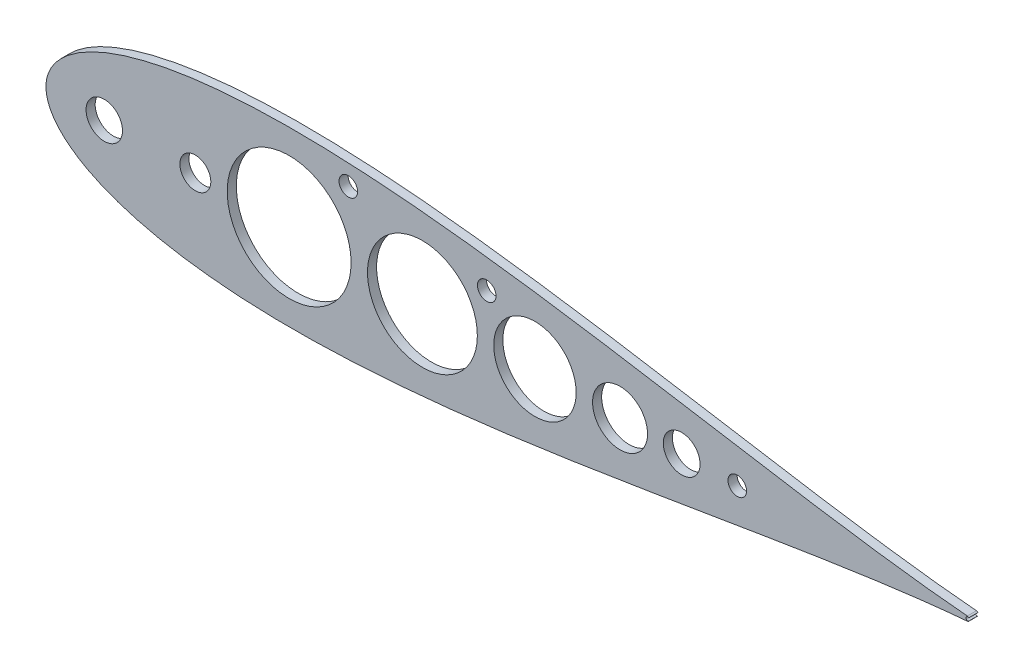
ISO-10303-21;
HEADER;
FILE_DESCRIPTION(('STEP AP214'),'2;1');
FILE_NAME('part.step','',(''),(''),'','','');
FILE_SCHEMA(('AUTOMOTIVE_DESIGN { 1 0 10303 214 1 1 1 1 }'));
ENDSEC;
DATA;
#1=APPLICATION_CONTEXT('core data for automotive mechanical design processes');
#2=APPLICATION_PROTOCOL_DEFINITION('international standard','automotive_design',2000,#1);
#3=PRODUCT_CONTEXT('',#1,'mechanical');
#4=PRODUCT('Part','Part','',(#3));
#5=PRODUCT_RELATED_PRODUCT_CATEGORY('part','',(#4));
#6=PRODUCT_DEFINITION_FORMATION('','',#4);
#7=PRODUCT_DEFINITION_CONTEXT('part definition',#1,'design');
#8=PRODUCT_DEFINITION('design','',#6,#7);
#9=PRODUCT_DEFINITION_SHAPE('','',#8);
#10=(LENGTH_UNIT() NAMED_UNIT(*) SI_UNIT(.MILLI.,.METRE.));
#11=(NAMED_UNIT(*) PLANE_ANGLE_UNIT() SI_UNIT($,.RADIAN.));
#12=(NAMED_UNIT(*) SI_UNIT($,.STERADIAN.) SOLID_ANGLE_UNIT());
#13=UNCERTAINTY_MEASURE_WITH_UNIT(LENGTH_MEASURE(1.E-05),#10,'distance_accuracy_value','');
#14=(GEOMETRIC_REPRESENTATION_CONTEXT(3) GLOBAL_UNCERTAINTY_ASSIGNED_CONTEXT((#13)) GLOBAL_UNIT_ASSIGNED_CONTEXT((#10,
#11,#12)) REPRESENTATION_CONTEXT('',''));
#15=CARTESIAN_POINT('',(0.,0.,0.));
#16=DIRECTION('',(0.,0.,1.));
#17=DIRECTION('',(1.,0.,0.));
#18=AXIS2_PLACEMENT_3D('',#15,#16,#17);
#19=CARTESIAN_POINT('',(670.56,0.,6.34999999999986));
#20=CARTESIAN_POINT('',(670.56,0.0156785949268264,6.34999999999986));
#21=CARTESIAN_POINT('',(666.344759682885,0.0546967077380209,6.34999999999986));
#22=CARTESIAN_POINT('',(662.850933167968,0.234427605388464,6.34999999999986));
#23=CARTESIAN_POINT('',(656.504964310749,0.543558382914665,6.34999999999986));
#24=CARTESIAN_POINT('',(649.292951764021,1.03477125279463,6.34999999999986));
#25=CARTESIAN_POINT('',(640.49155963975,1.73191957841822,6.34999999999986));
#26=CARTESIAN_POINT('',(630.413817461935,2.66338549322028,6.34999999999986));
#27=CARTESIAN_POINT('',(619.014124193102,3.84925366408522,6.34999999999986));
#28=CARTESIAN_POINT('',(606.37498851238,5.30442898343119,6.34999999999986));
#29=CARTESIAN_POINT('',(592.543922516217,7.03763490710043,6.34999999999986));
#30=CARTESIAN_POINT('',(577.585454095337,9.05063614704151,6.34999999999986));
#31=CARTESIAN_POINT('',(561.564270734499,11.3389196249108,6.34999999999986));
#32=CARTESIAN_POINT('',(544.549749945783,13.8906653749143,6.34999999999986));
#33=CARTESIAN_POINT('',(526.614143657614,16.687720752969,6.34999999999986));
#34=CARTESIAN_POINT('',(507.832591566438,19.7051116629441,6.34999999999986));
#35=CARTESIAN_POINT('',(488.28271028846,22.911672600905,6.34999999999986));
#36=CARTESIAN_POINT('',(468.04436773457,26.2704360601485,6.34999999999986));
#37=CARTESIAN_POINT('',(447.199424328287,29.7390074319527,6.34999999999986));
#38=CARTESIAN_POINT('',(425.831595832134,33.2703241206413,6.34999999999986));
#39=CARTESIAN_POINT('',(404.026315660115,36.8132205450789,6.34999999999986));
#40=CARTESIAN_POINT('',(381.870662855574,40.3132668564462,6.34999999999986));
#41=CARTESIAN_POINT('',(359.45331489519,43.7135025323023,6.34999999999986));
#42=CARTESIAN_POINT('',(336.864544150044,46.9554474567625,6.34999999999986));
#43=CARTESIAN_POINT('',(314.196207315012,49.9798438951446,6.34999999999986));
#44=CARTESIAN_POINT('',(291.541767703989,52.7277127038914,6.34999999999986));
#45=CARTESIAN_POINT('',(268.996310773138,55.1412010116264,6.34999999999986));
#46=CARTESIAN_POINT('',(246.656558649997,57.1646038288049,6.34999999999986));
#47=CARTESIAN_POINT('',(224.620860897201,58.7451766411797,6.34999999999986));
#48=CARTESIAN_POINT('',(202.989192599403,59.8341217002379,6.34999999999986));
#49=CARTESIAN_POINT('',(181.863132616042,60.38750614212,6.34999999999986));
#50=CARTESIAN_POINT('',(161.345829026568,60.3669613241372,6.34999999999986));
#51=CARTESIAN_POINT('',(141.542033827972,59.7398958243377,6.34999999999986));
#52=CARTESIAN_POINT('',(122.558104572902,58.4817581038394,6.34999999999986));
#53=CARTESIAN_POINT('',(104.502313427195,56.5743039322433,6.34999999999986));
#54=CARTESIAN_POINT('',(87.4850186361546,54.0089351991655,6.34999999999986));
#55=CARTESIAN_POINT('',(71.6196960831898,50.7847520029958,6.34999999999986));
#56=CARTESIAN_POINT('',(57.0237097246999,46.9125430655859,6.34999999999986));
#57=CARTESIAN_POINT('',(43.8204543300276,42.4150024601016,6.34999999999986));
#58=CARTESIAN_POINT('',(32.1416452388822,37.3322040286462,6.34999999999986));
#59=CARTESIAN_POINT('',(22.1291073753193,31.7314553388245,6.34999999999986));
#60=CARTESIAN_POINT('',(13.9324235239131,25.7264121059535,6.34999999999986));
#61=CARTESIAN_POINT('',(7.6896164890983,19.5132076319135,6.34999999999986));
#62=CARTESIAN_POINT('',(3.46313634309126,13.420354420661,6.34999999999986));
#63=CARTESIAN_POINT('',(1.10633322756684,7.92338943472272,6.34999999999986));
#64=CARTESIAN_POINT('',(0.154611581573635,3.51379661507288,6.34999999999986));
#65=CARTESIAN_POINT('',(-0.062151597606766,1.73472347597681E-13,6.34999999999986));
#66=CARTESIAN_POINT('',(0.154611581573635,-3.5137966150731,6.34999999999986));
#67=CARTESIAN_POINT('',(1.10633322756687,-7.92338943472269,6.34999999999986));
#68=CARTESIAN_POINT('',(3.46313634309126,-13.420354420661,6.34999999999986));
#69=CARTESIAN_POINT('',(7.68961648909824,-19.5132076319134,6.34999999999986));
#70=CARTESIAN_POINT('',(13.9324235239131,-25.7264121059535,6.34999999999986));
#71=CARTESIAN_POINT('',(22.1291073753193,-31.7314553388245,6.34999999999986));
#72=CARTESIAN_POINT('',(32.1416452388821,-37.3322040286461,6.34999999999986));
#73=CARTESIAN_POINT('',(43.8204543300276,-42.4150024601016,6.34999999999986));
#74=CARTESIAN_POINT('',(57.0237097246997,-46.9125430655858,6.34999999999986));
#75=CARTESIAN_POINT('',(71.6196960831899,-50.7847520029957,6.34999999999986));
#76=CARTESIAN_POINT('',(87.4850186361545,-54.0089351991654,6.34999999999986));
#77=CARTESIAN_POINT('',(104.502313427195,-56.5743039322433,6.34999999999986));
#78=CARTESIAN_POINT('',(122.558104572901,-58.4817581038394,6.34999999999986));
#79=CARTESIAN_POINT('',(141.542033827972,-59.7398958243377,6.34999999999986));
#80=CARTESIAN_POINT('',(161.345829026568,-60.3669613241371,6.34999999999986));
#81=CARTESIAN_POINT('',(181.863132616042,-60.38750614212,6.34999999999986));
#82=CARTESIAN_POINT('',(202.989192599403,-59.8341217002379,6.34999999999986));
#83=CARTESIAN_POINT('',(224.620860897201,-58.7451766411797,6.34999999999986));
#84=CARTESIAN_POINT('',(246.656558649997,-57.164603828805,6.34999999999986));
#85=CARTESIAN_POINT('',(268.996310773138,-55.1412010116265,6.34999999999986));
#86=CARTESIAN_POINT('',(291.541767703989,-52.7277127038913,6.34999999999986));
#87=CARTESIAN_POINT('',(314.196207315012,-49.9798438951445,6.34999999999986));
#88=CARTESIAN_POINT('',(336.864544150043,-46.9554474567626,6.34999999999986));
#89=CARTESIAN_POINT('',(359.45331489519,-43.7135025323022,6.34999999999986));
#90=CARTESIAN_POINT('',(381.870662855574,-40.3132668564461,6.34999999999986));
#91=CARTESIAN_POINT('',(404.026315660115,-36.8132205450789,6.34999999999986));
#92=CARTESIAN_POINT('',(425.831595832133,-33.2703241206413,6.34999999999986));
#93=CARTESIAN_POINT('',(447.199424328287,-29.7390074319526,6.34999999999986));
#94=CARTESIAN_POINT('',(468.04436773457,-26.2704360601485,6.34999999999986));
#95=CARTESIAN_POINT('',(488.28271028846,-22.9116726009051,6.34999999999986));
#96=CARTESIAN_POINT('',(507.832591566438,-19.7051116629441,6.34999999999986));
#97=CARTESIAN_POINT('',(526.614143657614,-16.687720752969,6.34999999999986));
#98=CARTESIAN_POINT('',(544.549749945782,-13.8906653749143,6.34999999999986));
#99=CARTESIAN_POINT('',(561.564270734499,-11.338919624911,6.34999999999986));
#100=CARTESIAN_POINT('',(577.585454095337,-9.05063614704178,6.34999999999986));
#101=CARTESIAN_POINT('',(592.543922516217,-7.03763490710061,6.34999999999986));
#102=CARTESIAN_POINT('',(606.37498851238,-5.30442898343107,6.34999999999986));
#103=CARTESIAN_POINT('',(619.014124193101,-3.84925366408537,6.34999999999986));
#104=CARTESIAN_POINT('',(630.413817461935,-2.6633854932203,6.34999999999986));
#105=CARTESIAN_POINT('',(640.491559639751,-1.73191957841837,6.34999999999986));
#106=CARTESIAN_POINT('',(649.29295176402,-1.03477125279464,6.34999999999986));
#107=CARTESIAN_POINT('',(656.504964310749,-0.543558382914679,6.34999999999986));
#108=CARTESIAN_POINT('',(662.850933167967,-0.234427605388561,6.34999999999986));
#109=CARTESIAN_POINT('',(666.344759682885,-0.0546967077382013,6.34999999999986));
#110=CARTESIAN_POINT('',(670.56,-0.0156785949268489,6.34999999999986));
#111=CARTESIAN_POINT('',(670.56,0.,6.34999999999986));
#112=B_SPLINE_CURVE_WITH_KNOTS('',3,(#19,#20,#21,#22,#23,#24,#25,#26,#27,#28,#29,#30,#31,#32,
#33,#34,#35,#36,#37,#38,#39,#40,#41,#42,#43,#44,#45,#46,#47,#48,#49,#50,#51,#52,#53,#54,#55,#56,
#57,#58,#59,#60,#61,#62,#63,#64,#65,#66,#67,#68,#69,#70,#71,#72,#73,#74,#75,#76,#77,#78,#79,#80,
#81,#82,#83,#84,#85,#86,#87,#88,#89,#90,#91,#92,#93,#94,#95,#96,#97,#98,#99,#100,#101,#102,#103,
#104,#105,#106,#107,#108,#109,#110,#111),.UNSPECIFIED.,.T.,.F.,(4,1,1,1,1,1,1,1,1,1,1,1,1,1,1,1,
1,1,1,1,1,1,1,1,1,1,1,1,1,1,1,1,1,1,1,1,1,1,1,1,1,1,1,1,1,1,1,1,1,1,1,1,1,1,1,1,1,1,1,1,1,1,1,1,
1,1,1,1,1,1,1,1,1,1,1,1,1,1,1,1,1,1,1,1,1,1,1,1,1,1,4),(0.,0.00216777795588342,
0.00539478220000884,0.00966720698444134,0.0149667883303173,0.0212708876900959,
0.0285525550130683,0.0367806836725549,0.0459201019032637,0.0559317636633187,0.0667728836144854,
0.0783971303496518,0.0907548266908363,0.103793164577546,0.117456431914319,0.131686225652521,
0.146421738497113,0.161599998000845,0.177156132626574,0.193023668070302,0.209134785631037,
0.225420632511523,0.241811601924249,0.258237646860869,0.274628556698349,0.290914287398014,
0.307025228908797,0.322892517177238,0.33844834182358,0.353626206573582,0.368361231970712,
0.382590427827798,0.396252960572084,0.40929041186716,0.421647009590256,0.433269881487031,
0.444109248914041,0.454118639688981,0.463255054987312,0.471479113777303,0.478755288570903,
0.485052318112802,0.490344025694165,0.494609832614287,0.497833231437255,0.5,0.502166768562745,
0.505390167385713,0.509655974305835,0.514947681887198,0.521244711429097,0.528520886222697,
0.536744945012688,0.545881360311019,0.555890751085959,0.566730118512969,0.578352990409744,
0.59070958813284,0.603747039427916,0.617409572172202,0.631638768029288,0.646373793426418,
0.66155165817642,0.677107482822761,0.692974771091203,0.709085712601986,0.725371443301651,
0.741762353139131,0.758188398075751,0.774579367488477,0.790865214368963,0.806976331929698,
0.822843867373426,0.838400001999155,0.853578261502887,0.868313774347479,0.882543568085681,
0.896206835422454,0.909245173309164,0.921602869650348,0.933227116385514,0.944068236336681,
0.954079898096736,0.963219316327445,0.971447444986932,0.978729112309904,0.985033211669683,
0.990332793015559,0.994605217799991,0.997832222044117,1.),.UNSPECIFIED.);
#113=DIRECTION('',(0.,0.,-0.999999999999998));
#114=VECTOR('',#113,1.);
#115=SURFACE_OF_LINEAR_EXTRUSION('',#112,#114);
#116=CARTESIAN_POINT('',(670.56,0.,0.));
#117=CARTESIAN_POINT('',(670.56,0.0156785949268264,0.));
#118=CARTESIAN_POINT('',(666.344759682885,0.0546967077380209,0.));
#119=CARTESIAN_POINT('',(662.850933167968,0.234427605388464,0.));
#120=CARTESIAN_POINT('',(656.504964310749,0.543558382914665,0.));
#121=CARTESIAN_POINT('',(649.292951764021,1.03477125279463,0.));
#122=CARTESIAN_POINT('',(640.49155963975,1.73191957841822,0.));
#123=CARTESIAN_POINT('',(630.413817461935,2.66338549322028,0.));
#124=CARTESIAN_POINT('',(619.014124193102,3.84925366408522,0.));
#125=CARTESIAN_POINT('',(606.37498851238,5.30442898343119,0.));
#126=CARTESIAN_POINT('',(592.543922516217,7.03763490710043,0.));
#127=CARTESIAN_POINT('',(577.585454095337,9.05063614704151,0.));
#128=CARTESIAN_POINT('',(561.564270734499,11.3389196249108,0.));
#129=CARTESIAN_POINT('',(544.549749945783,13.8906653749143,0.));
#130=CARTESIAN_POINT('',(526.614143657614,16.687720752969,0.));
#131=CARTESIAN_POINT('',(507.832591566438,19.7051116629441,0.));
#132=CARTESIAN_POINT('',(488.28271028846,22.911672600905,0.));
#133=CARTESIAN_POINT('',(468.04436773457,26.2704360601485,0.));
#134=CARTESIAN_POINT('',(447.199424328287,29.7390074319527,0.));
#135=CARTESIAN_POINT('',(425.831595832134,33.2703241206413,0.));
#136=CARTESIAN_POINT('',(404.026315660115,36.8132205450789,0.));
#137=CARTESIAN_POINT('',(381.870662855574,40.3132668564462,0.));
#138=CARTESIAN_POINT('',(359.45331489519,43.7135025323023,0.));
#139=CARTESIAN_POINT('',(336.864544150044,46.9554474567625,0.));
#140=CARTESIAN_POINT('',(314.196207315012,49.9798438951446,0.));
#141=CARTESIAN_POINT('',(291.541767703989,52.7277127038914,0.));
#142=CARTESIAN_POINT('',(268.996310773138,55.1412010116264,0.));
#143=CARTESIAN_POINT('',(246.656558649997,57.1646038288049,0.));
#144=CARTESIAN_POINT('',(224.620860897201,58.7451766411797,0.));
#145=CARTESIAN_POINT('',(202.989192599403,59.8341217002379,0.));
#146=CARTESIAN_POINT('',(181.863132616042,60.38750614212,0.));
#147=CARTESIAN_POINT('',(161.345829026568,60.3669613241372,0.));
#148=CARTESIAN_POINT('',(141.542033827972,59.7398958243377,0.));
#149=CARTESIAN_POINT('',(122.558104572902,58.4817581038394,0.));
#150=CARTESIAN_POINT('',(104.502313427195,56.5743039322433,0.));
#151=CARTESIAN_POINT('',(87.4850186361546,54.0089351991655,0.));
#152=CARTESIAN_POINT('',(71.6196960831898,50.7847520029958,0.));
#153=CARTESIAN_POINT('',(57.0237097246999,46.9125430655859,0.));
#154=CARTESIAN_POINT('',(43.8204543300276,42.4150024601016,0.));
#155=CARTESIAN_POINT('',(32.1416452388822,37.3322040286462,0.));
#156=CARTESIAN_POINT('',(22.1291073753193,31.7314553388245,0.));
#157=CARTESIAN_POINT('',(13.9324235239131,25.7264121059535,0.));
#158=CARTESIAN_POINT('',(7.68961648909831,19.5132076319135,0.));
#159=CARTESIAN_POINT('',(3.46313634309126,13.420354420661,0.));
#160=CARTESIAN_POINT('',(1.10633322756684,7.92338943472272,0.));
#161=CARTESIAN_POINT('',(0.154611581573635,3.51379661507288,0.));
#162=CARTESIAN_POINT('',(-0.0621515976067522,1.52655665885959E-13,0.));
#163=CARTESIAN_POINT('',(0.154611581573635,-3.5137966150731,0.));
#164=CARTESIAN_POINT('',(1.10633322756687,-7.92338943472269,0.));
#165=CARTESIAN_POINT('',(3.46313634309126,-13.420354420661,0.));
#166=CARTESIAN_POINT('',(7.68961648909824,-19.5132076319134,0.));
#167=CARTESIAN_POINT('',(13.9324235239131,-25.7264121059535,0.));
#168=CARTESIAN_POINT('',(22.1291073753193,-31.7314553388245,0.));
#169=CARTESIAN_POINT('',(32.1416452388821,-37.3322040286461,0.));
#170=CARTESIAN_POINT('',(43.8204543300276,-42.4150024601016,0.));
#171=CARTESIAN_POINT('',(57.0237097246997,-46.9125430655858,0.));
#172=CARTESIAN_POINT('',(71.6196960831899,-50.7847520029957,0.));
#173=CARTESIAN_POINT('',(87.4850186361545,-54.0089351991654,0.));
#174=CARTESIAN_POINT('',(104.502313427195,-56.5743039322433,0.));
#175=CARTESIAN_POINT('',(122.558104572901,-58.4817581038394,0.));
#176=CARTESIAN_POINT('',(141.542033827972,-59.7398958243377,0.));
#177=CARTESIAN_POINT('',(161.345829026568,-60.3669613241371,0.));
#178=CARTESIAN_POINT('',(181.863132616042,-60.38750614212,0.));
#179=CARTESIAN_POINT('',(202.989192599403,-59.8341217002379,0.));
#180=CARTESIAN_POINT('',(224.620860897201,-58.7451766411797,0.));
#181=CARTESIAN_POINT('',(246.656558649997,-57.164603828805,0.));
#182=CARTESIAN_POINT('',(268.996310773138,-55.1412010116265,0.));
#183=CARTESIAN_POINT('',(291.541767703989,-52.7277127038913,0.));
#184=CARTESIAN_POINT('',(314.196207315012,-49.9798438951445,0.));
#185=CARTESIAN_POINT('',(336.864544150043,-46.9554474567626,0.));
#186=CARTESIAN_POINT('',(359.45331489519,-43.7135025323022,0.));
#187=CARTESIAN_POINT('',(381.870662855574,-40.3132668564461,0.));
#188=CARTESIAN_POINT('',(404.026315660115,-36.8132205450789,0.));
#189=CARTESIAN_POINT('',(425.831595832133,-33.2703241206413,0.));
#190=CARTESIAN_POINT('',(447.199424328287,-29.7390074319526,0.));
#191=CARTESIAN_POINT('',(468.04436773457,-26.2704360601485,0.));
#192=CARTESIAN_POINT('',(488.28271028846,-22.9116726009051,0.));
#193=CARTESIAN_POINT('',(507.832591566438,-19.7051116629441,0.));
#194=CARTESIAN_POINT('',(526.614143657614,-16.687720752969,0.));
#195=CARTESIAN_POINT('',(544.549749945782,-13.8906653749143,0.));
#196=CARTESIAN_POINT('',(561.564270734499,-11.338919624911,0.));
#197=CARTESIAN_POINT('',(577.585454095337,-9.05063614704178,0.));
#198=CARTESIAN_POINT('',(592.543922516217,-7.03763490710061,0.));
#199=CARTESIAN_POINT('',(606.37498851238,-5.30442898343107,0.));
#200=CARTESIAN_POINT('',(619.014124193101,-3.84925366408537,0.));
#201=CARTESIAN_POINT('',(630.413817461935,-2.6633854932203,0.));
#202=CARTESIAN_POINT('',(640.491559639751,-1.73191957841837,0.));
#203=CARTESIAN_POINT('',(649.29295176402,-1.03477125279464,0.));
#204=CARTESIAN_POINT('',(656.504964310749,-0.543558382914679,0.));
#205=CARTESIAN_POINT('',(662.850933167967,-0.234427605388561,0.));
#206=CARTESIAN_POINT('',(666.344759682885,-0.0546967077382013,0.));
#207=CARTESIAN_POINT('',(670.56,-0.0156785949268489,0.));
#208=CARTESIAN_POINT('',(670.56,0.,0.));
#209=B_SPLINE_CURVE_WITH_KNOTS('',3,(#116,#117,#118,#119,#120,#121,#122,#123,#124,#125,#126,
#127,#128,#129,#130,#131,#132,#133,#134,#135,#136,#137,#138,#139,#140,#141,#142,#143,#144,#145,
#146,#147,#148,#149,#150,#151,#152,#153,#154,#155,#156,#157,#158,#159,#160,#161,#162,#163,#164,
#165,#166,#167,#168,#169,#170,#171,#172,#173,#174,#175,#176,#177,#178,#179,#180,#181,#182,#183,
#184,#185,#186,#187,#188,#189,#190,#191,#192,#193,#194,#195,#196,#197,#198,#199,#200,#201,#202,
#203,#204,#205,#206,#207,#208),.UNSPECIFIED.,.T.,.F.,(4,1,1,1,1,1,1,1,1,1,1,1,1,1,1,1,1,1,1,1,1,
1,1,1,1,1,1,1,1,1,1,1,1,1,1,1,1,1,1,1,1,1,1,1,1,1,1,1,1,1,1,1,1,1,1,1,1,1,1,1,1,1,1,1,1,1,1,1,1,
1,1,1,1,1,1,1,1,1,1,1,1,1,1,1,1,1,1,1,1,1,4),(0.,0.00216777795588342,0.00539478220000884,
0.00966720698444134,0.0149667883303173,0.0212708876900959,0.0285525550130683,0.0367806836725549,
0.0459201019032637,0.0559317636633187,0.0667728836144854,0.0783971303496518,0.0907548266908363,
0.103793164577546,0.117456431914319,0.131686225652521,0.146421738497113,0.161599998000845,
0.177156132626574,0.193023668070302,0.209134785631037,0.225420632511523,0.241811601924249,
0.258237646860869,0.274628556698349,0.290914287398014,0.307025228908797,0.322892517177238,
0.33844834182358,0.353626206573582,0.368361231970712,0.382590427827798,0.396252960572084,
0.40929041186716,0.421647009590256,0.433269881487031,0.444109248914041,0.454118639688981,
0.463255054987312,0.471479113777303,0.478755288570903,0.485052318112802,0.490344025694165,
0.494609832614287,0.497833231437255,0.5,0.502166768562745,0.505390167385713,0.509655974305835,
0.514947681887198,0.521244711429097,0.528520886222697,0.536744945012688,0.545881360311019,
0.555890751085959,0.566730118512969,0.578352990409744,0.59070958813284,0.603747039427916,
0.617409572172202,0.631638768029288,0.646373793426418,0.66155165817642,0.677107482822761,
0.692974771091203,0.709085712601986,0.725371443301651,0.741762353139131,0.758188398075751,
0.774579367488477,0.790865214368963,0.806976331929698,0.822843867373426,0.838400001999155,
0.853578261502887,0.868313774347479,0.882543568085681,0.896206835422454,0.909245173309164,
0.921602869650348,0.933227116385514,0.944068236336681,0.954079898096736,0.963219316327445,
0.971447444986932,0.978729112309904,0.985033211669683,0.990332793015559,0.994605217799991,
0.997832222044117,1.),.UNSPECIFIED.);
#210=CARTESIAN_POINT('',(642.510849283044,1.58203911233978,0.));
#211=VERTEX_POINT('',#210);
#212=CARTESIAN_POINT('',(642.510849283044,-1.58203911233971,0.));
#213=VERTEX_POINT('',#212);
#214=EDGE_CURVE('E95',#211,#213,#209,.T.);
#215=ORIENTED_EDGE('',*,*,#214,.T.);
#216=DIRECTION('',(0.,0.,-0.999999999999998));
#217=VECTOR('',#216,1.);
#218=CARTESIAN_POINT('',(642.510849283044,-1.58203911233971,6.34999999999986));
#219=LINE('',#218,#217);
#220=CARTESIAN_POINT('',(642.510849283044,-1.58203911233971,6.34999999999986));
#221=VERTEX_POINT('',#220);
#222=EDGE_CURVE('E13',#221,#213,#219,.T.);
#223=ORIENTED_EDGE('',*,*,#222,.F.);
#224=CARTESIAN_POINT('',(642.510849283044,1.58203911233978,6.34999999999986));
#225=VERTEX_POINT('',#224);
#226=EDGE_CURVE('E101',#225,#221,#112,.T.);
#227=ORIENTED_EDGE('',*,*,#226,.F.);
#228=DIRECTION('',(0.,0.,-0.999999999999998));
#229=VECTOR('',#228,1.);
#230=CARTESIAN_POINT('',(642.510849283044,1.58203911233978,6.34999999999986));
#231=LINE('',#230,#229);
#232=EDGE_CURVE('E121',#225,#211,#231,.T.);
#233=ORIENTED_EDGE('',*,*,#232,.T.);
#234=EDGE_LOOP('',(#215,#223,#227,#233));
#235=FACE_BOUND('',#234,.T.);
#236=ADVANCED_FACE('F58',(#235),#115,.F.);
#237=CARTESIAN_POINT('',(642.379287521778,-2.84494650060196E-13,6.34999999999986));
#238=DIRECTION('',(0.,0.,-0.999999999999998));
#239=DIRECTION('',(-1.,0.,0.));
#240=AXIS2_PLACEMENT_3D('',#237,#238,#239);
#241=CYLINDRICAL_SURFACE('',#240,1.58750000000001);
#242=CARTESIAN_POINT('',(642.379287521778,-2.84494650060196E-13,0.));
#243=DIRECTION('',(0.,0.,0.999999999999998));
#244=DIRECTION('',(1.,0.,0.));
#245=AXIS2_PLACEMENT_3D('',#242,#243,#244);
#246=CIRCLE('',#245,1.58750000000001);
#247=CARTESIAN_POINT('',(643.599082689009,-1.016,0.));
#248=VERTEX_POINT('',#247);
#249=EDGE_CURVE('E117',#213,#248,#246,.T.);
#250=ORIENTED_EDGE('',*,*,#249,.T.);
#251=DIRECTION('',(0.,0.,-0.999999999999998));
#252=VECTOR('',#251,1.);
#253=CARTESIAN_POINT('',(643.599082689009,-1.016,6.34999999999986));
#254=LINE('',#253,#252);
#255=CARTESIAN_POINT('',(643.599082689009,-1.016,6.34999999999986));
#256=VERTEX_POINT('',#255);
#257=EDGE_CURVE('E69',#256,#248,#254,.T.);
#258=ORIENTED_EDGE('',*,*,#257,.F.);
#259=CARTESIAN_POINT('',(642.379287521778,-2.84494650060196E-13,6.34999999999986));
#260=DIRECTION('',(0.,0.,0.999999999999998));
#261=DIRECTION('',(1.,0.,0.));
#262=AXIS2_PLACEMENT_3D('',#259,#260,#261);
#263=CIRCLE('',#262,1.58750000000001);
#264=EDGE_CURVE('E81',#221,#256,#263,.T.);
#265=ORIENTED_EDGE('',*,*,#264,.F.);
#266=ORIENTED_EDGE('',*,*,#222,.T.);
#267=EDGE_LOOP('',(#250,#258,#265,#266));
#268=FACE_BOUND('',#267,.T.);
#269=ADVANCED_FACE('F247',(#268),#241,.T.);
#270=CARTESIAN_POINT('',(642.837082689009,0.,6.34999999999986));
#271=DIRECTION('',(0.,0.,-0.999999999999998));
#272=DIRECTION('',(-1.,0.,0.));
#273=AXIS2_PLACEMENT_3D('',#270,#271,#272);
#274=CYLINDRICAL_SURFACE('',#273,1.26999999999999);
#275=CARTESIAN_POINT('',(642.837082689009,0.,0.));
#276=DIRECTION('',(0.,0.,0.999999999999998));
#277=DIRECTION('',(1.,0.,0.));
#278=AXIS2_PLACEMENT_3D('',#275,#276,#277);
#279=CIRCLE('',#278,1.26999999999999);
#280=CARTESIAN_POINT('',(643.599082689009,1.0159999999999,0.));
#281=VERTEX_POINT('',#280);
#282=EDGE_CURVE('E176',#281,#248,#279,.T.);
#283=ORIENTED_EDGE('',*,*,#282,.F.);
#284=DIRECTION('',(0.,0.,-0.999999999999998));
#285=VECTOR('',#284,1.);
#286=CARTESIAN_POINT('',(643.599082689009,1.0159999999999,6.34999999999986));
#287=LINE('',#286,#285);
#288=CARTESIAN_POINT('',(643.599082689009,1.0159999999999,6.34999999999986));
#289=VERTEX_POINT('',#288);
#290=EDGE_CURVE('E126',#289,#281,#287,.T.);
#291=ORIENTED_EDGE('',*,*,#290,.F.);
#292=CARTESIAN_POINT('',(642.837082689009,0.,6.34999999999986));
#293=DIRECTION('',(0.,0.,0.999999999999998));
#294=DIRECTION('',(1.,0.,0.));
#295=AXIS2_PLACEMENT_3D('',#292,#293,#294);
#296=CIRCLE('',#295,1.26999999999999);
#297=EDGE_CURVE('E157',#289,#256,#296,.T.);
#298=ORIENTED_EDGE('',*,*,#297,.T.);
#299=ORIENTED_EDGE('',*,*,#257,.T.);
#300=EDGE_LOOP('',(#283,#291,#298,#299));
#301=FACE_BOUND('',#300,.T.);
#302=ADVANCED_FACE('F251',(#301),#274,.F.);
#303=CARTESIAN_POINT('',(104.14,0.,6.34999999999986));
#304=DIRECTION('',(0.,0.,-0.999999999999998));
#305=DIRECTION('',(-1.,0.,0.));
#306=AXIS2_PLACEMENT_3D('',#303,#304,#305);
#307=CYLINDRICAL_SURFACE('',#306,10.795);
#308=CARTESIAN_POINT('',(104.14,0.,0.));
#309=DIRECTION('',(0.,0.,0.999999999999998));
#310=DIRECTION('',(1.,0.,0.));
#311=AXIS2_PLACEMENT_3D('',#308,#309,#310);
#312=CIRCLE('',#311,10.795);
#313=CARTESIAN_POINT('',(114.935,0.,0.));
#314=VERTEX_POINT('',#313);
#315=EDGE_CURVE('E178',#314,#314,#312,.T.);
#316=ORIENTED_EDGE('',*,*,#315,.F.);
#317=EDGE_LOOP('',(#316));
#318=FACE_BOUND('',#317,.T.);
#319=CARTESIAN_POINT('',(104.14,0.,6.34999999999986));
#320=DIRECTION('',(0.,0.,0.999999999999998));
#321=DIRECTION('',(1.,0.,0.));
#322=AXIS2_PLACEMENT_3D('',#319,#320,#321);
#323=CIRCLE('',#322,10.795);
#324=CARTESIAN_POINT('',(114.935,0.,6.34999999999986));
#325=VERTEX_POINT('',#324);
#326=EDGE_CURVE('E161',#325,#325,#323,.T.);
#327=ORIENTED_EDGE('',*,*,#326,.T.);
#328=EDGE_LOOP('',(#327));
#329=FACE_BOUND('',#328,.T.);
#330=ADVANCED_FACE('F256',(#318,#329),#307,.F.);
#331=CARTESIAN_POINT('',(40.6399999999999,0.,6.34999999999986));
#332=DIRECTION('',(0.,0.,-0.999999999999998));
#333=DIRECTION('',(-1.,0.,0.));
#334=AXIS2_PLACEMENT_3D('',#331,#332,#333);
#335=CYLINDRICAL_SURFACE('',#334,12.7);
#336=CARTESIAN_POINT('',(40.6399999999999,0.,0.));
#337=DIRECTION('',(0.,0.,0.999999999999998));
#338=DIRECTION('',(1.,0.,0.));
#339=AXIS2_PLACEMENT_3D('',#336,#337,#338);
#340=CIRCLE('',#339,12.7);
#341=CARTESIAN_POINT('',(53.3399999999999,0.,0.));
#342=VERTEX_POINT('',#341);
#343=EDGE_CURVE('E151',#342,#342,#340,.T.);
#344=ORIENTED_EDGE('',*,*,#343,.F.);
#345=EDGE_LOOP('',(#344));
#346=FACE_BOUND('',#345,.T.);
#347=CARTESIAN_POINT('',(40.6399999999999,0.,6.34999999999986));
#348=DIRECTION('',(0.,0.,0.999999999999998));
#349=DIRECTION('',(1.,0.,0.));
#350=AXIS2_PLACEMENT_3D('',#347,#348,#349);
#351=CIRCLE('',#350,12.7);
#352=CARTESIAN_POINT('',(53.3399999999999,0.,6.34999999999986));
#353=VERTEX_POINT('',#352);
#354=EDGE_CURVE('E165',#353,#353,#351,.T.);
#355=ORIENTED_EDGE('',*,*,#354,.T.);
#356=EDGE_LOOP('',(#355));
#357=FACE_BOUND('',#356,.T.);
#358=ADVANCED_FACE('F262',(#346,#357),#335,.F.);
#359=CARTESIAN_POINT('',(0.,0.,6.34999999999986));
#360=DIRECTION('',(0.,0.,0.999999999999998));
#361=DIRECTION('',(1.,0.,0.));
#362=AXIS2_PLACEMENT_3D('',#359,#360,#361);
#363=PLANE('',#362);
#364=CARTESIAN_POINT('',(210.82,45.2120000000001,6.34999999999986));
#365=DIRECTION('',(0.,0.,0.999999999999998));
#366=DIRECTION('',(1.,0.,0.));
#367=AXIS2_PLACEMENT_3D('',#364,#365,#366);
#368=CIRCLE('',#367,6.47700000000001);
#369=CARTESIAN_POINT('',(217.297,45.2120000000001,6.34999999999986));
#370=VERTEX_POINT('',#369);
#371=EDGE_CURVE('E140',#370,#370,#368,.T.);
#372=ORIENTED_EDGE('',*,*,#371,.F.);
#373=EDGE_LOOP('',(#372));
#374=FACE_BOUND('',#373,.T.);
#375=CARTESIAN_POINT('',(307.34,30.48,6.34999999999986));
#376=DIRECTION('',(0.,0.,0.999999999999998));
#377=DIRECTION('',(1.,0.,0.));
#378=AXIS2_PLACEMENT_3D('',#375,#376,#377);
#379=CIRCLE('',#378,6.47700000000001);
#380=CARTESIAN_POINT('',(313.817,30.48,6.34999999999986));
#381=VERTEX_POINT('',#380);
#382=EDGE_CURVE('E281',#381,#381,#379,.T.);
#383=ORIENTED_EDGE('',*,*,#382,.F.);
#384=EDGE_LOOP('',(#383));
#385=FACE_BOUND('',#384,.T.);
#386=ORIENTED_EDGE('',*,*,#354,.F.);
#387=EDGE_LOOP('',(#386));
#388=FACE_BOUND('',#387,.T.);
#389=ORIENTED_EDGE('',*,*,#326,.F.);
#390=EDGE_LOOP('',(#389));
#391=FACE_BOUND('',#390,.T.);
#392=ORIENTED_EDGE('',*,*,#297,.F.);
#393=CARTESIAN_POINT('',(642.379287521778,-2.84494650060196E-13,6.34999999999986));
#394=DIRECTION('',(0.,0.,-0.999999999999998));
#395=DIRECTION('',(1.,0.,0.));
#396=AXIS2_PLACEMENT_3D('',#393,#394,#395);
#397=CIRCLE('',#396,1.58750000000001);
#398=EDGE_CURVE('E127',#225,#289,#397,.T.);
#399=ORIENTED_EDGE('',*,*,#398,.F.);
#400=ORIENTED_EDGE('',*,*,#226,.T.);
#401=ORIENTED_EDGE('',*,*,#264,.T.);
#402=EDGE_LOOP('',(#392,#399,#400,#401));
#403=FACE_BOUND('',#402,.T.);
#404=CARTESIAN_POINT('',(482.082534569452,-7.56339435525888E-13,6.34999999999986));
#405=DIRECTION('',(0.,0.,0.999999999999998));
#406=DIRECTION('',(1.,0.,0.));
#407=AXIS2_PLACEMENT_3D('',#404,#405,#406);
#408=CIRCLE('',#407,6.47700000000001);
#409=CARTESIAN_POINT('',(488.559534569452,-7.56339435525888E-13,6.34999999999986));
#410=VERTEX_POINT('',#409);
#411=EDGE_CURVE('E190',#410,#410,#408,.T.);
#412=ORIENTED_EDGE('',*,*,#411,.F.);
#413=EDGE_LOOP('',(#412));
#414=FACE_BOUND('',#413,.T.);
#415=CARTESIAN_POINT('',(443.301866123466,4.23272528138341E-13,6.34999999999986));
#416=DIRECTION('',(0.,0.,0.999999999999998));
#417=DIRECTION('',(1.,0.,0.));
#418=AXIS2_PLACEMENT_3D('',#415,#416,#417);
#419=CIRCLE('',#418,12.827);
#420=CARTESIAN_POINT('',(456.128866123466,4.23272528138341E-13,6.34999999999986));
#421=VERTEX_POINT('',#420);
#422=EDGE_CURVE('E194',#421,#421,#419,.T.);
#423=ORIENTED_EDGE('',*,*,#422,.F.);
#424=EDGE_LOOP('',(#423));
#425=FACE_BOUND('',#424,.T.);
#426=CARTESIAN_POINT('',(400.327663748457,0.,6.34999999999986));
#427=DIRECTION('',(0.,0.,0.999999999999998));
#428=DIRECTION('',(1.,0.,0.));
#429=AXIS2_PLACEMENT_3D('',#426,#427,#428);
#430=CIRCLE('',#429,19.177);
#431=CARTESIAN_POINT('',(419.504663748457,0.,6.34999999999986));
#432=VERTEX_POINT('',#431);
#433=EDGE_CURVE('E199',#432,#432,#430,.T.);
#434=ORIENTED_EDGE('',*,*,#433,.F.);
#435=EDGE_LOOP('',(#434));
#436=FACE_BOUND('',#435,.T.);
#437=CARTESIAN_POINT('',(340.979907753812,1.04083408558608E-13,6.34999999999986));
#438=DIRECTION('',(0.,0.,0.999999999999998));
#439=DIRECTION('',(1.,0.,0.));
#440=AXIS2_PLACEMENT_3D('',#437,#438,#439);
#441=CIRCLE('',#440,28.7407559946448);
#442=CARTESIAN_POINT('',(369.720663748457,1.04083408558608E-13,6.34999999999986));
#443=VERTEX_POINT('',#442);
#444=EDGE_CURVE('E203',#443,#443,#441,.T.);
#445=ORIENTED_EDGE('',*,*,#444,.F.);
#446=EDGE_LOOP('',(#445));
#447=FACE_BOUND('',#446,.T.);
#448=CARTESIAN_POINT('',(262.503550953445,0.,6.34999999999986));
#449=DIRECTION('',(0.,0.,0.999999999999998));
#450=DIRECTION('',(1.,0.,0.));
#451=AXIS2_PLACEMENT_3D('',#448,#449,#450);
#452=CIRCLE('',#451,38.3056008057221);
#453=CARTESIAN_POINT('',(300.809151759167,0.,6.34999999999986));
#454=VERTEX_POINT('',#453);
#455=EDGE_CURVE('E207',#454,#454,#452,.T.);
#456=ORIENTED_EDGE('',*,*,#455,.F.);
#457=EDGE_LOOP('',(#456));
#458=FACE_BOUND('',#457,.T.);
#459=CARTESIAN_POINT('',(169.566475073861,0.,6.34999999999986));
#460=DIRECTION('',(0.,0.,0.999999999999998));
#461=DIRECTION('',(1.,0.,0.));
#462=AXIS2_PLACEMENT_3D('',#459,#460,#461);
#463=CIRCLE('',#462,43.2014750738616);
#464=CARTESIAN_POINT('',(212.767950147723,0.,6.34999999999986));
#465=VERTEX_POINT('',#464);
#466=EDGE_CURVE('E119',#465,#465,#463,.T.);
#467=ORIENTED_EDGE('',*,*,#466,.F.);
#468=EDGE_LOOP('',(#467));
#469=FACE_BOUND('',#468,.T.);
#470=ADVANCED_FACE('F266',(#374,#385,#388,#391,#403,#414,#425,#436,#447,#458,#469),#363,.T.);
#471=CARTESIAN_POINT('',(0.,0.,0.));
#472=DIRECTION('',(0.,0.,0.999999999999998));
#473=DIRECTION('',(1.,0.,0.));
#474=AXIS2_PLACEMENT_3D('',#471,#472,#473);
#475=PLANE('',#474);
#476=CARTESIAN_POINT('',(210.82,45.2120000000001,0.));
#477=DIRECTION('',(0.,0.,0.999999999999998));
#478=DIRECTION('',(1.,0.,0.));
#479=AXIS2_PLACEMENT_3D('',#476,#477,#478);
#480=CIRCLE('',#479,6.47700000000001);
#481=CARTESIAN_POINT('',(217.297,45.2120000000001,0.));
#482=VERTEX_POINT('',#481);
#483=EDGE_CURVE('E133',#482,#482,#480,.T.);
#484=ORIENTED_EDGE('',*,*,#483,.T.);
#485=EDGE_LOOP('',(#484));
#486=FACE_BOUND('',#485,.T.);
#487=CARTESIAN_POINT('',(307.34,30.48,0.));
#488=DIRECTION('',(0.,0.,0.999999999999998));
#489=DIRECTION('',(1.,0.,0.));
#490=AXIS2_PLACEMENT_3D('',#487,#488,#489);
#491=CIRCLE('',#490,6.47700000000001);
#492=CARTESIAN_POINT('',(313.817,30.48,0.));
#493=VERTEX_POINT('',#492);
#494=EDGE_CURVE('E303',#493,#493,#491,.T.);
#495=ORIENTED_EDGE('',*,*,#494,.T.);
#496=EDGE_LOOP('',(#495));
#497=FACE_BOUND('',#496,.T.);
#498=CARTESIAN_POINT('',(169.566475073861,0.,0.));
#499=DIRECTION('',(0.,0.,0.999999999999998));
#500=DIRECTION('',(1.,0.,0.));
#501=AXIS2_PLACEMENT_3D('',#498,#499,#500);
#502=CIRCLE('',#501,43.2014750738616);
#503=CARTESIAN_POINT('',(212.767950147723,0.,0.));
#504=VERTEX_POINT('',#503);
#505=EDGE_CURVE('E62',#504,#504,#502,.T.);
#506=ORIENTED_EDGE('',*,*,#505,.T.);
#507=EDGE_LOOP('',(#506));
#508=FACE_BOUND('',#507,.T.);
#509=CARTESIAN_POINT('',(262.503550953445,0.,0.));
#510=DIRECTION('',(0.,0.,0.999999999999998));
#511=DIRECTION('',(1.,0.,0.));
#512=AXIS2_PLACEMENT_3D('',#509,#510,#511);
#513=CIRCLE('',#512,38.3056008057221);
#514=CARTESIAN_POINT('',(300.809151759167,0.,0.));
#515=VERTEX_POINT('',#514);
#516=EDGE_CURVE('E195',#515,#515,#513,.T.);
#517=ORIENTED_EDGE('',*,*,#516,.T.);
#518=EDGE_LOOP('',(#517));
#519=FACE_BOUND('',#518,.T.);
#520=CARTESIAN_POINT('',(340.979907753812,1.04083408558608E-13,0.));
#521=DIRECTION('',(0.,0.,0.999999999999998));
#522=DIRECTION('',(1.,0.,0.));
#523=AXIS2_PLACEMENT_3D('',#520,#521,#522);
#524=CIRCLE('',#523,28.7407559946448);
#525=CARTESIAN_POINT('',(369.720663748457,1.04083408558608E-13,0.));
#526=VERTEX_POINT('',#525);
#527=EDGE_CURVE('E214',#526,#526,#524,.T.);
#528=ORIENTED_EDGE('',*,*,#527,.T.);
#529=EDGE_LOOP('',(#528));
#530=FACE_BOUND('',#529,.T.);
#531=CARTESIAN_POINT('',(400.327663748457,0.,0.));
#532=DIRECTION('',(0.,0.,0.999999999999998));
#533=DIRECTION('',(1.,0.,0.));
#534=AXIS2_PLACEMENT_3D('',#531,#532,#533);
#535=CIRCLE('',#534,19.177);
#536=CARTESIAN_POINT('',(419.504663748457,0.,0.));
#537=VERTEX_POINT('',#536);
#538=EDGE_CURVE('E218',#537,#537,#535,.T.);
#539=ORIENTED_EDGE('',*,*,#538,.T.);
#540=EDGE_LOOP('',(#539));
#541=FACE_BOUND('',#540,.T.);
#542=CARTESIAN_POINT('',(443.301866123466,4.23272528138341E-13,0.));
#543=DIRECTION('',(0.,0.,0.999999999999998));
#544=DIRECTION('',(1.,0.,0.));
#545=AXIS2_PLACEMENT_3D('',#542,#543,#544);
#546=CIRCLE('',#545,12.827);
#547=CARTESIAN_POINT('',(456.128866123466,4.23272528138341E-13,0.));
#548=VERTEX_POINT('',#547);
#549=EDGE_CURVE('E222',#548,#548,#546,.T.);
#550=ORIENTED_EDGE('',*,*,#549,.T.);
#551=EDGE_LOOP('',(#550));
#552=FACE_BOUND('',#551,.T.);
#553=CARTESIAN_POINT('',(482.082534569452,-7.56339435525888E-13,0.));
#554=DIRECTION('',(0.,0.,0.999999999999998));
#555=DIRECTION('',(1.,0.,0.));
#556=AXIS2_PLACEMENT_3D('',#553,#554,#555);
#557=CIRCLE('',#556,6.47700000000001);
#558=CARTESIAN_POINT('',(488.559534569452,-7.56339435525888E-13,0.));
#559=VERTEX_POINT('',#558);
#560=EDGE_CURVE('E145',#559,#559,#557,.T.);
#561=ORIENTED_EDGE('',*,*,#560,.T.);
#562=EDGE_LOOP('',(#561));
#563=FACE_BOUND('',#562,.T.);
#564=ORIENTED_EDGE('',*,*,#343,.T.);
#565=EDGE_LOOP('',(#564));
#566=FACE_BOUND('',#565,.T.);
#567=ORIENTED_EDGE('',*,*,#315,.T.);
#568=EDGE_LOOP('',(#567));
#569=FACE_BOUND('',#568,.T.);
#570=CARTESIAN_POINT('',(642.379287521778,-2.84494650060196E-13,0.));
#571=DIRECTION('',(0.,0.,-0.999999999999998));
#572=DIRECTION('',(1.,0.,0.));
#573=AXIS2_PLACEMENT_3D('',#570,#571,#572);
#574=CIRCLE('',#573,1.58750000000001);
#575=EDGE_CURVE('E115',#211,#281,#574,.T.);
#576=ORIENTED_EDGE('',*,*,#575,.T.);
#577=ORIENTED_EDGE('',*,*,#282,.T.);
#578=ORIENTED_EDGE('',*,*,#249,.F.);
#579=ORIENTED_EDGE('',*,*,#214,.F.);
#580=EDGE_LOOP('',(#576,#577,#578,#579));
#581=FACE_BOUND('',#580,.T.);
#582=ADVANCED_FACE('F112',(#486,#497,#508,#519,#530,#541,#552,#563,#566,#569,#581),#475,.F.);
#583=CARTESIAN_POINT('',(169.566475073861,0.,0.));
#584=DIRECTION('',(0.,0.,0.999999999999998));
#585=DIRECTION('',(1.,0.,0.));
#586=AXIS2_PLACEMENT_3D('',#583,#584,#585);
#587=CYLINDRICAL_SURFACE('',#586,43.2014750738616);
#588=ORIENTED_EDGE('',*,*,#466,.T.);
#589=EDGE_LOOP('',(#588));
#590=FACE_BOUND('',#589,.T.);
#591=ORIENTED_EDGE('',*,*,#505,.F.);
#592=EDGE_LOOP('',(#591));
#593=FACE_BOUND('',#592,.T.);
#594=ADVANCED_FACE('F234',(#590,#593),#587,.F.);
#595=CARTESIAN_POINT('',(482.082534569452,-7.56339435525888E-13,0.));
#596=DIRECTION('',(0.,0.,0.999999999999998));
#597=DIRECTION('',(1.,0.,0.));
#598=AXIS2_PLACEMENT_3D('',#595,#596,#597);
#599=CYLINDRICAL_SURFACE('',#598,6.47700000000001);
#600=ORIENTED_EDGE('',*,*,#411,.T.);
#601=EDGE_LOOP('',(#600));
#602=FACE_BOUND('',#601,.T.);
#603=ORIENTED_EDGE('',*,*,#560,.F.);
#604=EDGE_LOOP('',(#603));
#605=FACE_BOUND('',#604,.T.);
#606=ADVANCED_FACE('F231',(#602,#605),#599,.F.);
#607=CARTESIAN_POINT('',(443.301866123466,4.23272528138341E-13,0.));
#608=DIRECTION('',(0.,0.,0.999999999999998));
#609=DIRECTION('',(1.,0.,0.));
#610=AXIS2_PLACEMENT_3D('',#607,#608,#609);
#611=CYLINDRICAL_SURFACE('',#610,12.827);
#612=ORIENTED_EDGE('',*,*,#422,.T.);
#613=EDGE_LOOP('',(#612));
#614=FACE_BOUND('',#613,.T.);
#615=ORIENTED_EDGE('',*,*,#549,.F.);
#616=EDGE_LOOP('',(#615));
#617=FACE_BOUND('',#616,.T.);
#618=ADVANCED_FACE('F233',(#614,#617),#611,.F.);
#619=CARTESIAN_POINT('',(400.327663748457,0.,0.));
#620=DIRECTION('',(0.,0.,0.999999999999998));
#621=DIRECTION('',(1.,0.,0.));
#622=AXIS2_PLACEMENT_3D('',#619,#620,#621);
#623=CYLINDRICAL_SURFACE('',#622,19.177);
#624=ORIENTED_EDGE('',*,*,#433,.T.);
#625=EDGE_LOOP('',(#624));
#626=FACE_BOUND('',#625,.T.);
#627=ORIENTED_EDGE('',*,*,#538,.F.);
#628=EDGE_LOOP('',(#627));
#629=FACE_BOUND('',#628,.T.);
#630=ADVANCED_FACE('F241',(#626,#629),#623,.F.);
#631=CARTESIAN_POINT('',(340.979907753812,1.04083408558608E-13,0.));
#632=DIRECTION('',(0.,0.,0.999999999999998));
#633=DIRECTION('',(1.,0.,0.));
#634=AXIS2_PLACEMENT_3D('',#631,#632,#633);
#635=CYLINDRICAL_SURFACE('',#634,28.7407559946448);
#636=ORIENTED_EDGE('',*,*,#444,.T.);
#637=EDGE_LOOP('',(#636));
#638=FACE_BOUND('',#637,.T.);
#639=ORIENTED_EDGE('',*,*,#527,.F.);
#640=EDGE_LOOP('',(#639));
#641=FACE_BOUND('',#640,.T.);
#642=ADVANCED_FACE('F328',(#638,#641),#635,.F.);
#643=CARTESIAN_POINT('',(262.503550953445,0.,0.));
#644=DIRECTION('',(0.,0.,0.999999999999998));
#645=DIRECTION('',(1.,0.,0.));
#646=AXIS2_PLACEMENT_3D('',#643,#644,#645);
#647=CYLINDRICAL_SURFACE('',#646,38.3056008057221);
#648=ORIENTED_EDGE('',*,*,#455,.T.);
#649=EDGE_LOOP('',(#648));
#650=FACE_BOUND('',#649,.T.);
#651=ORIENTED_EDGE('',*,*,#516,.F.);
#652=EDGE_LOOP('',(#651));
#653=FACE_BOUND('',#652,.T.);
#654=ADVANCED_FACE('F322',(#650,#653),#647,.F.);
#655=CARTESIAN_POINT('',(642.379287521778,-2.84494650060196E-13,6.34999999999986));
#656=DIRECTION('',(0.,0.,-0.999999999999998));
#657=DIRECTION('',(-1.,0.,0.));
#658=AXIS2_PLACEMENT_3D('',#655,#656,#657);
#659=CYLINDRICAL_SURFACE('',#658,1.58750000000001);
#660=ORIENTED_EDGE('',*,*,#575,.F.);
#661=ORIENTED_EDGE('',*,*,#232,.F.);
#662=ORIENTED_EDGE('',*,*,#398,.T.);
#663=ORIENTED_EDGE('',*,*,#290,.T.);
#664=EDGE_LOOP('',(#660,#661,#662,#663));
#665=FACE_BOUND('',#664,.T.);
#666=ADVANCED_FACE('F130',(#665),#659,.T.);
#667=CARTESIAN_POINT('',(307.34,30.48,0.));
#668=DIRECTION('',(0.,0.,0.999999999999998));
#669=DIRECTION('',(1.,0.,0.));
#670=AXIS2_PLACEMENT_3D('',#667,#668,#669);
#671=CYLINDRICAL_SURFACE('',#670,6.47700000000001);
#672=ORIENTED_EDGE('',*,*,#494,.F.);
#673=EDGE_LOOP('',(#672));
#674=FACE_BOUND('',#673,.T.);
#675=ORIENTED_EDGE('',*,*,#382,.T.);
#676=EDGE_LOOP('',(#675));
#677=FACE_BOUND('',#676,.T.);
#678=ADVANCED_FACE('F311',(#674,#677),#671,.F.);
#679=CARTESIAN_POINT('',(210.82,45.2120000000001,0.));
#680=DIRECTION('',(0.,0.,0.999999999999998));
#681=DIRECTION('',(1.,0.,0.));
#682=AXIS2_PLACEMENT_3D('',#679,#680,#681);
#683=CYLINDRICAL_SURFACE('',#682,6.47700000000001);
#684=ORIENTED_EDGE('',*,*,#483,.F.);
#685=EDGE_LOOP('',(#684));
#686=FACE_BOUND('',#685,.T.);
#687=ORIENTED_EDGE('',*,*,#371,.T.);
#688=EDGE_LOOP('',(#687));
#689=FACE_BOUND('',#688,.T.);
#690=ADVANCED_FACE('F313',(#686,#689),#683,.F.);
#691=CLOSED_SHELL('',(#236,#269,#302,#330,#358,#470,#582,#594,#606,#618,#630,#642,#654,#666,
#678,#690));
#692=MANIFOLD_SOLID_BREP('B2',#691);
#693=ADVANCED_BREP_SHAPE_REPRESENTATION('',(#18,#692),#14);
#694=SHAPE_DEFINITION_REPRESENTATION(#9,#693);
ENDSEC;
END-ISO-10303-21;
